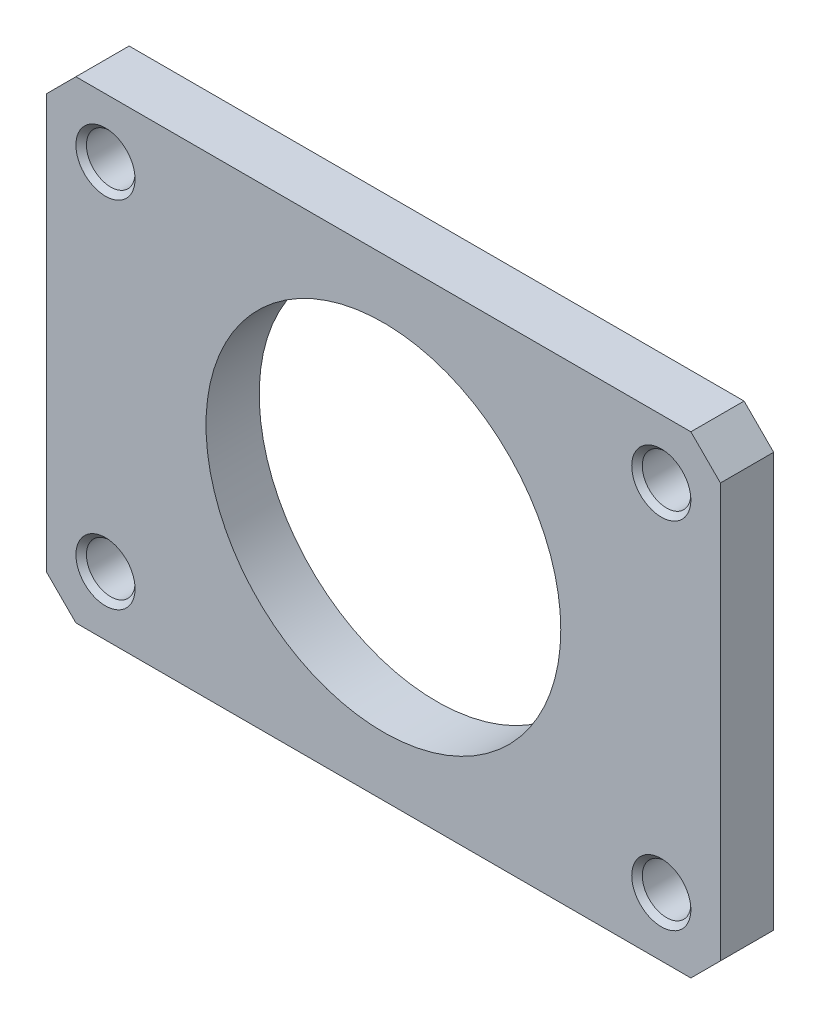
ISO-10303-21;
HEADER;
FILE_DESCRIPTION(('STEP AP214'),'2;1');
FILE_NAME('part.step','',(''),(''),'','','');
FILE_SCHEMA(('AUTOMOTIVE_DESIGN { 1 0 10303 214 1 1 1 1 }'));
ENDSEC;
DATA;
#1=APPLICATION_CONTEXT('core data for automotive mechanical design processes');
#2=APPLICATION_PROTOCOL_DEFINITION('international standard','automotive_design',2000,#1);
#3=PRODUCT_CONTEXT('',#1,'mechanical');
#4=PRODUCT('Part','Part','',(#3));
#5=PRODUCT_RELATED_PRODUCT_CATEGORY('part','',(#4));
#6=PRODUCT_DEFINITION_FORMATION('','',#4);
#7=PRODUCT_DEFINITION_CONTEXT('part definition',#1,'design');
#8=PRODUCT_DEFINITION('design','',#6,#7);
#9=PRODUCT_DEFINITION_SHAPE('','',#8);
#10=(LENGTH_UNIT() NAMED_UNIT(*) SI_UNIT(.MILLI.,.METRE.));
#11=(NAMED_UNIT(*) PLANE_ANGLE_UNIT() SI_UNIT($,.RADIAN.));
#12=(NAMED_UNIT(*) SI_UNIT($,.STERADIAN.) SOLID_ANGLE_UNIT());
#13=UNCERTAINTY_MEASURE_WITH_UNIT(LENGTH_MEASURE(1.E-05),#10,'distance_accuracy_value','');
#14=(GEOMETRIC_REPRESENTATION_CONTEXT(3) GLOBAL_UNCERTAINTY_ASSIGNED_CONTEXT((#13)) GLOBAL_UNIT_ASSIGNED_CONTEXT((#10,
#11,#12)) REPRESENTATION_CONTEXT('',''));
#15=CARTESIAN_POINT('',(0.,0.,0.));
#16=DIRECTION('',(0.,0.,1.));
#17=DIRECTION('',(1.,0.,0.));
#18=AXIS2_PLACEMENT_3D('',#15,#16,#17);
#19=CARTESIAN_POINT('',(0.,0.,4.5));
#20=DIRECTION('',(0.,0.,-1.));
#21=DIRECTION('',(-1.,0.,0.));
#22=AXIS2_PLACEMENT_3D('',#19,#20,#21);
#23=PLANE('',#22);
#24=CARTESIAN_POINT('',(-14.25,-10.,4.5));
#25=DIRECTION('',(0.,0.,1.));
#26=DIRECTION('',(1.,0.,0.));
#27=AXIS2_PLACEMENT_3D('',#24,#25,#26);
#28=CIRCLE('',#27,15.);
#29=CARTESIAN_POINT('',(0.749999999999994,-10.,4.5));
#30=VERTEX_POINT('',#29);
#31=EDGE_CURVE('E387',#30,#30,#28,.T.);
#32=ORIENTED_EDGE('',*,*,#31,.F.);
#33=EDGE_LOOP('',(#32));
#34=FACE_BOUND('',#33,.T.);
#35=CARTESIAN_POINT('',(9.24999999999999,5.,4.5));
#36=DIRECTION('',(0.,0.,-1.));
#37=DIRECTION('',(-1.,0.,0.));
#38=AXIS2_PLACEMENT_3D('',#35,#36,#37);
#39=CIRCLE('',#38,2.5);
#40=CARTESIAN_POINT('',(6.75,5.,4.5));
#41=VERTEX_POINT('',#40);
#42=EDGE_CURVE('E11',#41,#41,#39,.T.);
#43=ORIENTED_EDGE('',*,*,#42,.T.);
#44=EDGE_LOOP('',(#43));
#45=FACE_BOUND('',#44,.T.);
#46=DIRECTION('',(0.,1.,0.));
#47=VECTOR('',#46,1.);
#48=CARTESIAN_POINT('',(14.25,-10.,4.5));
#49=LINE('',#48,#47);
#50=CARTESIAN_POINT('',(14.25,-27.5,4.5));
#51=VERTEX_POINT('',#50);
#52=CARTESIAN_POINT('',(14.25,7.49999999999999,4.5));
#53=VERTEX_POINT('',#52);
#54=EDGE_CURVE('E194',#51,#53,#49,.T.);
#55=ORIENTED_EDGE('',*,*,#54,.T.);
#56=DIRECTION('',(0.707106781186547,-0.707106781186549,0.));
#57=VECTOR('',#56,1.);
#58=CARTESIAN_POINT('',(11.75,10.,4.5));
#59=LINE('',#58,#57);
#60=CARTESIAN_POINT('',(11.75,10.,4.5));
#61=VERTEX_POINT('',#60);
#62=EDGE_CURVE('E206',#53,#61,#59,.F.);
#63=ORIENTED_EDGE('',*,*,#62,.T.);
#64=DIRECTION('',(-1.,0.,0.));
#65=VECTOR('',#64,1.);
#66=CARTESIAN_POINT('',(-14.25,10.,4.5));
#67=LINE('',#66,#65);
#68=CARTESIAN_POINT('',(-40.25,10.,4.5));
#69=VERTEX_POINT('',#68);
#70=EDGE_CURVE('E196',#61,#69,#67,.T.);
#71=ORIENTED_EDGE('',*,*,#70,.T.);
#72=DIRECTION('',(-0.707106781186547,-0.707106781186549,0.));
#73=VECTOR('',#72,1.);
#74=CARTESIAN_POINT('',(-40.25,10.,4.5));
#75=LINE('',#74,#73);
#76=CARTESIAN_POINT('',(-42.75,7.49999999999999,4.5));
#77=VERTEX_POINT('',#76);
#78=EDGE_CURVE('E157',#77,#69,#75,.F.);
#79=ORIENTED_EDGE('',*,*,#78,.F.);
#80=DIRECTION('',(0.,1.,0.));
#81=VECTOR('',#80,1.);
#82=CARTESIAN_POINT('',(-42.75,-10.,4.5));
#83=LINE('',#82,#81);
#84=CARTESIAN_POINT('',(-42.75,-27.5,4.5));
#85=VERTEX_POINT('',#84);
#86=EDGE_CURVE('E145',#85,#77,#83,.T.);
#87=ORIENTED_EDGE('',*,*,#86,.F.);
#88=DIRECTION('',(-0.707106781186547,0.707106781186549,0.));
#89=VECTOR('',#88,1.);
#90=CARTESIAN_POINT('',(-40.25,-30.,4.5));
#91=LINE('',#90,#89);
#92=CARTESIAN_POINT('',(-40.25,-30.,4.5));
#93=VERTEX_POINT('',#92);
#94=EDGE_CURVE('E127',#85,#93,#91,.F.);
#95=ORIENTED_EDGE('',*,*,#94,.T.);
#96=DIRECTION('',(-1.,0.,0.));
#97=VECTOR('',#96,1.);
#98=CARTESIAN_POINT('',(-14.25,-30.,4.5));
#99=LINE('',#98,#97);
#100=CARTESIAN_POINT('',(11.75,-30.,4.5));
#101=VERTEX_POINT('',#100);
#102=EDGE_CURVE('E111',#101,#93,#99,.T.);
#103=ORIENTED_EDGE('',*,*,#102,.F.);
#104=DIRECTION('',(0.707106781186547,0.707106781186549,0.));
#105=VECTOR('',#104,1.);
#106=CARTESIAN_POINT('',(11.75,-30.,4.5));
#107=LINE('',#106,#105);
#108=EDGE_CURVE('E178',#51,#101,#107,.F.);
#109=ORIENTED_EDGE('',*,*,#108,.F.);
#110=EDGE_LOOP('',(#55,#63,#71,#79,#87,#95,#103,#109));
#111=FACE_BOUND('',#110,.T.);
#112=CARTESIAN_POINT('',(9.24999999999999,-25.,4.5));
#113=DIRECTION('',(0.,0.,1.));
#114=DIRECTION('',(-1.,0.,0.));
#115=AXIS2_PLACEMENT_3D('',#112,#113,#114);
#116=CIRCLE('',#115,2.5);
#117=CARTESIAN_POINT('',(6.75,-25.,4.5));
#118=VERTEX_POINT('',#117);
#119=EDGE_CURVE('E190',#118,#118,#116,.T.);
#120=ORIENTED_EDGE('',*,*,#119,.F.);
#121=EDGE_LOOP('',(#120));
#122=FACE_BOUND('',#121,.T.);
#123=CARTESIAN_POINT('',(-37.75,5.,4.5));
#124=DIRECTION('',(0.,0.,1.));
#125=DIRECTION('',(1.,0.,0.));
#126=AXIS2_PLACEMENT_3D('',#123,#124,#125);
#127=CIRCLE('',#126,2.5);
#128=CARTESIAN_POINT('',(-35.25,5.,4.5));
#129=VERTEX_POINT('',#128);
#130=EDGE_CURVE('E112',#129,#129,#127,.T.);
#131=ORIENTED_EDGE('',*,*,#130,.F.);
#132=EDGE_LOOP('',(#131));
#133=FACE_BOUND('',#132,.T.);
#134=CARTESIAN_POINT('',(-37.75,-25.,4.5));
#135=DIRECTION('',(0.,0.,-1.));
#136=DIRECTION('',(1.,0.,0.));
#137=AXIS2_PLACEMENT_3D('',#134,#135,#136);
#138=CIRCLE('',#137,2.5);
#139=CARTESIAN_POINT('',(-35.25,-25.,4.5));
#140=VERTEX_POINT('',#139);
#141=EDGE_CURVE('E141',#140,#140,#138,.T.);
#142=ORIENTED_EDGE('',*,*,#141,.T.);
#143=EDGE_LOOP('',(#142));
#144=FACE_BOUND('',#143,.T.);
#145=ADVANCED_FACE('F36',(#34,#45,#111,#122,#133,#144),#23,.F.);
#146=CARTESIAN_POINT('',(0.,0.,0.));
#147=DIRECTION('',(0.,0.,-1.));
#148=DIRECTION('',(-1.,0.,0.));
#149=AXIS2_PLACEMENT_3D('',#146,#147,#148);
#150=PLANE('',#149);
#151=CARTESIAN_POINT('',(-14.25,-10.,0.));
#152=DIRECTION('',(0.,0.,1.));
#153=DIRECTION('',(1.,0.,0.));
#154=AXIS2_PLACEMENT_3D('',#151,#152,#153);
#155=CIRCLE('',#154,15.);
#156=CARTESIAN_POINT('',(0.749999999999994,-10.,0.));
#157=VERTEX_POINT('',#156);
#158=EDGE_CURVE('E121',#157,#157,#155,.T.);
#159=ORIENTED_EDGE('',*,*,#158,.T.);
#160=EDGE_LOOP('',(#159));
#161=FACE_BOUND('',#160,.T.);
#162=CARTESIAN_POINT('',(9.24999999999999,5.,0.));
#163=DIRECTION('',(0.,0.,-1.));
#164=DIRECTION('',(-1.,0.,0.));
#165=AXIS2_PLACEMENT_3D('',#162,#163,#164);
#166=CIRCLE('',#165,2.50000000000001);
#167=CARTESIAN_POINT('',(6.74999999999999,5.,0.));
#168=VERTEX_POINT('',#167);
#169=EDGE_CURVE('E208',#168,#168,#166,.F.);
#170=ORIENTED_EDGE('',*,*,#169,.T.);
#171=EDGE_LOOP('',(#170));
#172=FACE_BOUND('',#171,.T.);
#173=DIRECTION('',(-1.,0.,0.));
#174=VECTOR('',#173,1.);
#175=CARTESIAN_POINT('',(-14.25,10.,0.));
#176=LINE('',#175,#174);
#177=CARTESIAN_POINT('',(11.75,10.,0.));
#178=VERTEX_POINT('',#177);
#179=CARTESIAN_POINT('',(-40.25,10.,0.));
#180=VERTEX_POINT('',#179);
#181=EDGE_CURVE('E197',#178,#180,#176,.T.);
#182=ORIENTED_EDGE('',*,*,#181,.F.);
#183=DIRECTION('',(-0.707106781186547,0.707106781186549,0.));
#184=VECTOR('',#183,1.);
#185=CARTESIAN_POINT('',(10.875,10.875,0.));
#186=LINE('',#185,#184);
#187=CARTESIAN_POINT('',(14.25,7.49999999999999,0.));
#188=VERTEX_POINT('',#187);
#189=EDGE_CURVE('E59',#178,#188,#186,.F.);
#190=ORIENTED_EDGE('',*,*,#189,.T.);
#191=DIRECTION('',(0.,1.,0.));
#192=VECTOR('',#191,1.);
#193=CARTESIAN_POINT('',(14.25,-10.,0.));
#194=LINE('',#193,#192);
#195=CARTESIAN_POINT('',(14.25,-27.5,0.));
#196=VERTEX_POINT('',#195);
#197=EDGE_CURVE('E193',#196,#188,#194,.T.);
#198=ORIENTED_EDGE('',*,*,#197,.F.);
#199=DIRECTION('',(-0.707106781186547,-0.707106781186549,0.));
#200=VECTOR('',#199,1.);
#201=CARTESIAN_POINT('',(10.875,-30.875,0.));
#202=LINE('',#201,#200);
#203=CARTESIAN_POINT('',(11.75,-30.,0.));
#204=VERTEX_POINT('',#203);
#205=EDGE_CURVE('E109',#204,#196,#202,.F.);
#206=ORIENTED_EDGE('',*,*,#205,.F.);
#207=DIRECTION('',(-1.,0.,0.));
#208=VECTOR('',#207,1.);
#209=CARTESIAN_POINT('',(-14.25,-30.,0.));
#210=LINE('',#209,#208);
#211=CARTESIAN_POINT('',(-40.25,-30.,0.));
#212=VERTEX_POINT('',#211);
#213=EDGE_CURVE('E101',#204,#212,#210,.T.);
#214=ORIENTED_EDGE('',*,*,#213,.T.);
#215=DIRECTION('',(0.707106781186547,-0.707106781186549,0.));
#216=VECTOR('',#215,1.);
#217=CARTESIAN_POINT('',(-39.375,-30.875,0.));
#218=LINE('',#217,#216);
#219=CARTESIAN_POINT('',(-42.75,-27.5,0.));
#220=VERTEX_POINT('',#219);
#221=EDGE_CURVE('E107',#212,#220,#218,.F.);
#222=ORIENTED_EDGE('',*,*,#221,.T.);
#223=DIRECTION('',(0.,1.,0.));
#224=VECTOR('',#223,1.);
#225=CARTESIAN_POINT('',(-42.75,-10.,0.));
#226=LINE('',#225,#224);
#227=CARTESIAN_POINT('',(-42.75,7.49999999999999,0.));
#228=VERTEX_POINT('',#227);
#229=EDGE_CURVE('E144',#220,#228,#226,.T.);
#230=ORIENTED_EDGE('',*,*,#229,.T.);
#231=DIRECTION('',(0.707106781186547,0.707106781186549,0.));
#232=VECTOR('',#231,1.);
#233=CARTESIAN_POINT('',(-39.375,10.875,0.));
#234=LINE('',#233,#232);
#235=EDGE_CURVE('E152',#180,#228,#234,.F.);
#236=ORIENTED_EDGE('',*,*,#235,.F.);
#237=EDGE_LOOP('',(#182,#190,#198,#206,#214,#222,#230,#236));
#238=FACE_BOUND('',#237,.T.);
#239=CARTESIAN_POINT('',(9.24999999999999,-25.,0.));
#240=DIRECTION('',(0.,0.,1.));
#241=DIRECTION('',(-1.,0.,0.));
#242=AXIS2_PLACEMENT_3D('',#239,#240,#241);
#243=CIRCLE('',#242,2.50000000000001);
#244=CARTESIAN_POINT('',(6.74999999999999,-25.,0.));
#245=VERTEX_POINT('',#244);
#246=EDGE_CURVE('E181',#245,#245,#243,.F.);
#247=ORIENTED_EDGE('',*,*,#246,.F.);
#248=EDGE_LOOP('',(#247));
#249=FACE_BOUND('',#248,.T.);
#250=CARTESIAN_POINT('',(-37.75,5.,0.));
#251=DIRECTION('',(0.,0.,1.));
#252=DIRECTION('',(1.,0.,0.));
#253=AXIS2_PLACEMENT_3D('',#250,#251,#252);
#254=CIRCLE('',#253,2.50000000000001);
#255=CARTESIAN_POINT('',(-35.25,5.,0.));
#256=VERTEX_POINT('',#255);
#257=EDGE_CURVE('E160',#256,#256,#254,.F.);
#258=ORIENTED_EDGE('',*,*,#257,.F.);
#259=EDGE_LOOP('',(#258));
#260=FACE_BOUND('',#259,.T.);
#261=CARTESIAN_POINT('',(-37.75,-25.,0.));
#262=DIRECTION('',(0.,0.,-1.));
#263=DIRECTION('',(1.,0.,0.));
#264=AXIS2_PLACEMENT_3D('',#261,#262,#263);
#265=CIRCLE('',#264,2.50000000000001);
#266=CARTESIAN_POINT('',(-35.25,-25.,0.));
#267=VERTEX_POINT('',#266);
#268=EDGE_CURVE('E132',#267,#267,#265,.F.);
#269=ORIENTED_EDGE('',*,*,#268,.T.);
#270=EDGE_LOOP('',(#269));
#271=FACE_BOUND('',#270,.T.);
#272=ADVANCED_FACE('F103',(#161,#172,#238,#249,#260,#271),#150,.T.);
#273=CARTESIAN_POINT('',(14.25,-10.,4.5));
#274=DIRECTION('',(-1.,0.,0.));
#275=DIRECTION('',(0.,0.,1.));
#276=AXIS2_PLACEMENT_3D('',#273,#274,#275);
#277=PLANE('',#276);
#278=ORIENTED_EDGE('',*,*,#197,.T.);
#279=DIRECTION('',(0.,0.,1.));
#280=VECTOR('',#279,1.);
#281=CARTESIAN_POINT('',(14.25,7.49999999999999,4.5));
#282=LINE('',#281,#280);
#283=EDGE_CURVE('E51',#188,#53,#282,.T.);
#284=ORIENTED_EDGE('',*,*,#283,.T.);
#285=ORIENTED_EDGE('',*,*,#54,.F.);
#286=DIRECTION('',(0.,0.,1.));
#287=VECTOR('',#286,1.);
#288=CARTESIAN_POINT('',(14.25,-27.5,4.5));
#289=LINE('',#288,#287);
#290=EDGE_CURVE('E175',#196,#51,#289,.T.);
#291=ORIENTED_EDGE('',*,*,#290,.F.);
#292=EDGE_LOOP('',(#278,#284,#285,#291));
#293=FACE_BOUND('',#292,.T.);
#294=ADVANCED_FACE('F226',(#293),#277,.F.);
#295=CARTESIAN_POINT('',(-14.25,10.,4.5));
#296=DIRECTION('',(0.,-1.,0.));
#297=DIRECTION('',(0.,0.,-1.));
#298=AXIS2_PLACEMENT_3D('',#295,#296,#297);
#299=PLANE('',#298);
#300=ORIENTED_EDGE('',*,*,#70,.F.);
#301=DIRECTION('',(0.,0.,-1.));
#302=VECTOR('',#301,1.);
#303=CARTESIAN_POINT('',(11.75,10.,4.5));
#304=LINE('',#303,#302);
#305=EDGE_CURVE('E199',#61,#178,#304,.T.);
#306=ORIENTED_EDGE('',*,*,#305,.T.);
#307=ORIENTED_EDGE('',*,*,#181,.T.);
#308=DIRECTION('',(0.,0.,-1.));
#309=VECTOR('',#308,1.);
#310=CARTESIAN_POINT('',(-40.25,10.,4.5));
#311=LINE('',#310,#309);
#312=EDGE_CURVE('E148',#69,#180,#311,.T.);
#313=ORIENTED_EDGE('',*,*,#312,.F.);
#314=EDGE_LOOP('',(#300,#306,#307,#313));
#315=FACE_BOUND('',#314,.T.);
#316=ADVANCED_FACE('F233',(#315),#299,.F.);
#317=CARTESIAN_POINT('',(9.24999999999999,5.,4.5));
#318=DIRECTION('',(0.,0.,-1.));
#319=DIRECTION('',(-1.,0.,0.));
#320=AXIS2_PLACEMENT_3D('',#317,#318,#319);
#321=CYLINDRICAL_SURFACE('',#320,2.055);
#322=CARTESIAN_POINT('',(9.24999999999999,5.,0.445000000000008));
#323=DIRECTION('',(0.,0.,-1.));
#324=DIRECTION('',(-1.,0.,0.));
#325=AXIS2_PLACEMENT_3D('',#322,#323,#324);
#326=CIRCLE('',#325,2.055);
#327=CARTESIAN_POINT('',(7.19499999999999,5.,0.445000000000008));
#328=VERTEX_POINT('',#327);
#329=EDGE_CURVE('E44',#328,#328,#326,.T.);
#330=ORIENTED_EDGE('',*,*,#329,.T.);
#331=EDGE_LOOP('',(#330));
#332=FACE_BOUND('',#331,.T.);
#333=CARTESIAN_POINT('',(9.24999999999999,5.,4.055));
#334=DIRECTION('',(0.,0.,-1.));
#335=DIRECTION('',(-1.,0.,0.));
#336=AXIS2_PLACEMENT_3D('',#333,#334,#335);
#337=CIRCLE('',#336,2.055);
#338=CARTESIAN_POINT('',(7.19499999999999,5.,4.055));
#339=VERTEX_POINT('',#338);
#340=EDGE_CURVE('E211',#339,#339,#337,.F.);
#341=ORIENTED_EDGE('',*,*,#340,.T.);
#342=EDGE_LOOP('',(#341));
#343=FACE_BOUND('',#342,.T.);
#344=ADVANCED_FACE('F216',(#332,#343),#321,.F.);
#345=CARTESIAN_POINT('',(11.75,10.,4.5));
#346=DIRECTION('',(-0.707106781186549,-0.707106781186547,0.));
#347=DIRECTION('',(0.,0.,-1.));
#348=AXIS2_PLACEMENT_3D('',#345,#346,#347);
#349=PLANE('',#348);
#350=ORIENTED_EDGE('',*,*,#62,.F.);
#351=ORIENTED_EDGE('',*,*,#283,.F.);
#352=ORIENTED_EDGE('',*,*,#189,.F.);
#353=ORIENTED_EDGE('',*,*,#305,.F.);
#354=EDGE_LOOP('',(#350,#351,#352,#353));
#355=FACE_BOUND('',#354,.T.);
#356=ADVANCED_FACE('F222',(#355),#349,.F.);
#357=CARTESIAN_POINT('',(9.24999999999999,5.,0.));
#358=DIRECTION('',(0.,0.,-1.));
#359=DIRECTION('',(-1.,0.,0.));
#360=AXIS2_PLACEMENT_3D('',#357,#358,#359);
#361=CONICAL_SURFACE('',#360,2.50000000000001,0.785398163397447);
#362=ORIENTED_EDGE('',*,*,#329,.F.);
#363=EDGE_LOOP('',(#362));
#364=FACE_BOUND('',#363,.T.);
#365=ORIENTED_EDGE('',*,*,#169,.F.);
#366=EDGE_LOOP('',(#365));
#367=FACE_BOUND('',#366,.T.);
#368=ADVANCED_FACE('F219',(#364,#367),#361,.F.);
#369=CARTESIAN_POINT('',(9.24999999999999,5.,4.055));
#370=DIRECTION('',(0.,0.,1.));
#371=DIRECTION('',(1.,0.,0.));
#372=AXIS2_PLACEMENT_3D('',#369,#370,#371);
#373=CONICAL_SURFACE('',#372,2.055,0.785398163397446);
#374=ORIENTED_EDGE('',*,*,#42,.F.);
#375=EDGE_LOOP('',(#374));
#376=FACE_BOUND('',#375,.T.);
#377=ORIENTED_EDGE('',*,*,#340,.F.);
#378=EDGE_LOOP('',(#377));
#379=FACE_BOUND('',#378,.T.);
#380=ADVANCED_FACE('F38',(#376,#379),#373,.F.);
#381=CARTESIAN_POINT('',(-14.25,-30.,4.5));
#382=DIRECTION('',(0.,1.,0.));
#383=DIRECTION('',(0.,0.,-1.));
#384=AXIS2_PLACEMENT_3D('',#381,#382,#383);
#385=PLANE('',#384);
#386=ORIENTED_EDGE('',*,*,#102,.T.);
#387=DIRECTION('',(0.,0.,-1.));
#388=VECTOR('',#387,1.);
#389=CARTESIAN_POINT('',(-40.25,-30.,4.5));
#390=LINE('',#389,#388);
#391=EDGE_CURVE('E115',#93,#212,#390,.T.);
#392=ORIENTED_EDGE('',*,*,#391,.T.);
#393=ORIENTED_EDGE('',*,*,#213,.F.);
#394=DIRECTION('',(0.,0.,-1.));
#395=VECTOR('',#394,1.);
#396=CARTESIAN_POINT('',(11.75,-30.,4.5));
#397=LINE('',#396,#395);
#398=EDGE_CURVE('E171',#101,#204,#397,.T.);
#399=ORIENTED_EDGE('',*,*,#398,.F.);
#400=EDGE_LOOP('',(#386,#392,#393,#399));
#401=FACE_BOUND('',#400,.T.);
#402=ADVANCED_FACE('F116',(#401),#385,.F.);
#403=CARTESIAN_POINT('',(9.24999999999999,-25.,4.5));
#404=DIRECTION('',(0.,0.,-1.));
#405=DIRECTION('',(-1.,0.,0.));
#406=AXIS2_PLACEMENT_3D('',#403,#404,#405);
#407=CYLINDRICAL_SURFACE('',#406,2.055);
#408=CARTESIAN_POINT('',(9.24999999999999,-25.,0.445000000000008));
#409=DIRECTION('',(0.,0.,1.));
#410=DIRECTION('',(-1.,0.,0.));
#411=AXIS2_PLACEMENT_3D('',#408,#409,#410);
#412=CIRCLE('',#411,2.055);
#413=CARTESIAN_POINT('',(7.19499999999999,-25.,0.445000000000008));
#414=VERTEX_POINT('',#413);
#415=EDGE_CURVE('E187',#414,#414,#412,.T.);
#416=ORIENTED_EDGE('',*,*,#415,.F.);
#417=EDGE_LOOP('',(#416));
#418=FACE_BOUND('',#417,.T.);
#419=CARTESIAN_POINT('',(9.24999999999999,-25.,4.055));
#420=DIRECTION('',(0.,0.,1.));
#421=DIRECTION('',(-1.,0.,0.));
#422=AXIS2_PLACEMENT_3D('',#419,#420,#421);
#423=CIRCLE('',#422,2.055);
#424=CARTESIAN_POINT('',(7.19499999999999,-25.,4.055));
#425=VERTEX_POINT('',#424);
#426=EDGE_CURVE('E184',#425,#425,#423,.F.);
#427=ORIENTED_EDGE('',*,*,#426,.F.);
#428=EDGE_LOOP('',(#427));
#429=FACE_BOUND('',#428,.T.);
#430=ADVANCED_FACE('F267',(#418,#429),#407,.F.);
#431=CARTESIAN_POINT('',(11.75,-30.,4.5));
#432=DIRECTION('',(-0.707106781186549,0.707106781186547,0.));
#433=DIRECTION('',(0.,0.,-1.));
#434=AXIS2_PLACEMENT_3D('',#431,#432,#433);
#435=PLANE('',#434);
#436=ORIENTED_EDGE('',*,*,#108,.T.);
#437=ORIENTED_EDGE('',*,*,#398,.T.);
#438=ORIENTED_EDGE('',*,*,#205,.T.);
#439=ORIENTED_EDGE('',*,*,#290,.T.);
#440=EDGE_LOOP('',(#436,#437,#438,#439));
#441=FACE_BOUND('',#440,.T.);
#442=ADVANCED_FACE('F263',(#441),#435,.F.);
#443=CARTESIAN_POINT('',(9.24999999999999,-25.,0.));
#444=DIRECTION('',(0.,0.,-1.));
#445=DIRECTION('',(-1.,0.,0.));
#446=AXIS2_PLACEMENT_3D('',#443,#444,#445);
#447=CONICAL_SURFACE('',#446,2.50000000000001,0.785398163397447);
#448=ORIENTED_EDGE('',*,*,#415,.T.);
#449=EDGE_LOOP('',(#448));
#450=FACE_BOUND('',#449,.T.);
#451=ORIENTED_EDGE('',*,*,#246,.T.);
#452=EDGE_LOOP('',(#451));
#453=FACE_BOUND('',#452,.T.);
#454=ADVANCED_FACE('F266',(#450,#453),#447,.F.);
#455=CARTESIAN_POINT('',(9.24999999999999,-25.,4.055));
#456=DIRECTION('',(0.,0.,1.));
#457=DIRECTION('',(1.,0.,0.));
#458=AXIS2_PLACEMENT_3D('',#455,#456,#457);
#459=CONICAL_SURFACE('',#458,2.055,0.785398163397446);
#460=ORIENTED_EDGE('',*,*,#119,.T.);
#461=EDGE_LOOP('',(#460));
#462=FACE_BOUND('',#461,.T.);
#463=ORIENTED_EDGE('',*,*,#426,.T.);
#464=EDGE_LOOP('',(#463));
#465=FACE_BOUND('',#464,.T.);
#466=ADVANCED_FACE('F273',(#462,#465),#459,.F.);
#467=CARTESIAN_POINT('',(-42.75,-10.,4.5));
#468=DIRECTION('',(1.,0.,0.));
#469=DIRECTION('',(0.,0.,1.));
#470=AXIS2_PLACEMENT_3D('',#467,#468,#469);
#471=PLANE('',#470);
#472=ORIENTED_EDGE('',*,*,#229,.F.);
#473=DIRECTION('',(0.,0.,1.));
#474=VECTOR('',#473,1.);
#475=CARTESIAN_POINT('',(-42.75,-27.5,4.5));
#476=LINE('',#475,#474);
#477=EDGE_CURVE('E124',#220,#85,#476,.T.);
#478=ORIENTED_EDGE('',*,*,#477,.T.);
#479=ORIENTED_EDGE('',*,*,#86,.T.);
#480=DIRECTION('',(0.,0.,1.));
#481=VECTOR('',#480,1.);
#482=CARTESIAN_POINT('',(-42.75,7.49999999999999,4.5));
#483=LINE('',#482,#481);
#484=EDGE_CURVE('E155',#228,#77,#483,.T.);
#485=ORIENTED_EDGE('',*,*,#484,.F.);
#486=EDGE_LOOP('',(#472,#478,#479,#485));
#487=FACE_BOUND('',#486,.T.);
#488=ADVANCED_FACE('F261',(#487),#471,.F.);
#489=CARTESIAN_POINT('',(-37.75,5.,4.5));
#490=DIRECTION('',(0.,0.,-1.));
#491=DIRECTION('',(1.,0.,0.));
#492=AXIS2_PLACEMENT_3D('',#489,#490,#491);
#493=CYLINDRICAL_SURFACE('',#492,2.055);
#494=CARTESIAN_POINT('',(-37.75,5.,0.445000000000008));
#495=DIRECTION('',(0.,0.,1.));
#496=DIRECTION('',(1.,0.,0.));
#497=AXIS2_PLACEMENT_3D('',#494,#495,#496);
#498=CIRCLE('',#497,2.055);
#499=CARTESIAN_POINT('',(-35.695,5.,0.445000000000008));
#500=VERTEX_POINT('',#499);
#501=EDGE_CURVE('E166',#500,#500,#498,.T.);
#502=ORIENTED_EDGE('',*,*,#501,.F.);
#503=EDGE_LOOP('',(#502));
#504=FACE_BOUND('',#503,.T.);
#505=CARTESIAN_POINT('',(-37.75,5.,4.055));
#506=DIRECTION('',(0.,0.,1.));
#507=DIRECTION('',(1.,0.,0.));
#508=AXIS2_PLACEMENT_3D('',#505,#506,#507);
#509=CIRCLE('',#508,2.055);
#510=CARTESIAN_POINT('',(-35.695,5.,4.055));
#511=VERTEX_POINT('',#510);
#512=EDGE_CURVE('E163',#511,#511,#509,.F.);
#513=ORIENTED_EDGE('',*,*,#512,.F.);
#514=EDGE_LOOP('',(#513));
#515=FACE_BOUND('',#514,.T.);
#516=ADVANCED_FACE('F285',(#504,#515),#493,.F.);
#517=CARTESIAN_POINT('',(-40.25,10.,4.5));
#518=DIRECTION('',(0.707106781186549,-0.707106781186547,0.));
#519=DIRECTION('',(0.,0.,-1.));
#520=AXIS2_PLACEMENT_3D('',#517,#518,#519);
#521=PLANE('',#520);
#522=ORIENTED_EDGE('',*,*,#78,.T.);
#523=ORIENTED_EDGE('',*,*,#312,.T.);
#524=ORIENTED_EDGE('',*,*,#235,.T.);
#525=ORIENTED_EDGE('',*,*,#484,.T.);
#526=EDGE_LOOP('',(#522,#523,#524,#525));
#527=FACE_BOUND('',#526,.T.);
#528=ADVANCED_FACE('F258',(#527),#521,.F.);
#529=CARTESIAN_POINT('',(-37.75,5.,0.));
#530=DIRECTION('',(0.,0.,-1.));
#531=DIRECTION('',(1.,0.,0.));
#532=AXIS2_PLACEMENT_3D('',#529,#530,#531);
#533=CONICAL_SURFACE('',#532,2.50000000000001,0.785398163397447);
#534=ORIENTED_EDGE('',*,*,#501,.T.);
#535=EDGE_LOOP('',(#534));
#536=FACE_BOUND('',#535,.T.);
#537=ORIENTED_EDGE('',*,*,#257,.T.);
#538=EDGE_LOOP('',(#537));
#539=FACE_BOUND('',#538,.T.);
#540=ADVANCED_FACE('F314',(#536,#539),#533,.F.);
#541=CARTESIAN_POINT('',(-37.75,5.,4.055));
#542=DIRECTION('',(0.,0.,1.));
#543=DIRECTION('',(-1.,0.,0.));
#544=AXIS2_PLACEMENT_3D('',#541,#542,#543);
#545=CONICAL_SURFACE('',#544,2.055,0.785398163397446);
#546=ORIENTED_EDGE('',*,*,#130,.T.);
#547=EDGE_LOOP('',(#546));
#548=FACE_BOUND('',#547,.T.);
#549=ORIENTED_EDGE('',*,*,#512,.T.);
#550=EDGE_LOOP('',(#549));
#551=FACE_BOUND('',#550,.T.);
#552=ADVANCED_FACE('F306',(#548,#551),#545,.F.);
#553=CARTESIAN_POINT('',(-37.75,-25.,4.5));
#554=DIRECTION('',(0.,0.,-1.));
#555=DIRECTION('',(1.,0.,0.));
#556=AXIS2_PLACEMENT_3D('',#553,#554,#555);
#557=CYLINDRICAL_SURFACE('',#556,2.055);
#558=CARTESIAN_POINT('',(-37.75,-25.,0.445000000000008));
#559=DIRECTION('',(0.,0.,-1.));
#560=DIRECTION('',(1.,0.,0.));
#561=AXIS2_PLACEMENT_3D('',#558,#559,#560);
#562=CIRCLE('',#561,2.055);
#563=CARTESIAN_POINT('',(-35.695,-25.,0.445000000000008));
#564=VERTEX_POINT('',#563);
#565=EDGE_CURVE('E138',#564,#564,#562,.T.);
#566=ORIENTED_EDGE('',*,*,#565,.T.);
#567=EDGE_LOOP('',(#566));
#568=FACE_BOUND('',#567,.T.);
#569=CARTESIAN_POINT('',(-37.75,-25.,4.055));
#570=DIRECTION('',(0.,0.,-1.));
#571=DIRECTION('',(1.,0.,0.));
#572=AXIS2_PLACEMENT_3D('',#569,#570,#571);
#573=CIRCLE('',#572,2.055);
#574=CARTESIAN_POINT('',(-35.695,-25.,4.055));
#575=VERTEX_POINT('',#574);
#576=EDGE_CURVE('E135',#575,#575,#573,.F.);
#577=ORIENTED_EDGE('',*,*,#576,.T.);
#578=EDGE_LOOP('',(#577));
#579=FACE_BOUND('',#578,.T.);
#580=ADVANCED_FACE('F304',(#568,#579),#557,.F.);
#581=CARTESIAN_POINT('',(-40.25,-30.,4.5));
#582=DIRECTION('',(0.707106781186549,0.707106781186547,0.));
#583=DIRECTION('',(0.,0.,-1.));
#584=AXIS2_PLACEMENT_3D('',#581,#582,#583);
#585=PLANE('',#584);
#586=ORIENTED_EDGE('',*,*,#94,.F.);
#587=ORIENTED_EDGE('',*,*,#477,.F.);
#588=ORIENTED_EDGE('',*,*,#221,.F.);
#589=ORIENTED_EDGE('',*,*,#391,.F.);
#590=EDGE_LOOP('',(#586,#587,#588,#589));
#591=FACE_BOUND('',#590,.T.);
#592=ADVANCED_FACE('F123',(#591),#585,.F.);
#593=CARTESIAN_POINT('',(-37.75,-25.,0.));
#594=DIRECTION('',(0.,0.,-1.));
#595=DIRECTION('',(1.,0.,0.));
#596=AXIS2_PLACEMENT_3D('',#593,#594,#595);
#597=CONICAL_SURFACE('',#596,2.50000000000001,0.785398163397447);
#598=ORIENTED_EDGE('',*,*,#565,.F.);
#599=EDGE_LOOP('',(#598));
#600=FACE_BOUND('',#599,.T.);
#601=ORIENTED_EDGE('',*,*,#268,.F.);
#602=EDGE_LOOP('',(#601));
#603=FACE_BOUND('',#602,.T.);
#604=ADVANCED_FACE('F300',(#600,#603),#597,.F.);
#605=CARTESIAN_POINT('',(-37.75,-25.,4.055));
#606=DIRECTION('',(0.,0.,1.));
#607=DIRECTION('',(-1.,0.,0.));
#608=AXIS2_PLACEMENT_3D('',#605,#606,#607);
#609=CONICAL_SURFACE('',#608,2.055,0.785398163397446);
#610=ORIENTED_EDGE('',*,*,#141,.F.);
#611=EDGE_LOOP('',(#610));
#612=FACE_BOUND('',#611,.T.);
#613=ORIENTED_EDGE('',*,*,#576,.F.);
#614=EDGE_LOOP('',(#613));
#615=FACE_BOUND('',#614,.T.);
#616=ADVANCED_FACE('F296',(#612,#615),#609,.F.);
#617=CARTESIAN_POINT('',(-14.25,-10.,0.));
#618=DIRECTION('',(0.,0.,1.));
#619=DIRECTION('',(1.,0.,0.));
#620=AXIS2_PLACEMENT_3D('',#617,#618,#619);
#621=CYLINDRICAL_SURFACE('',#620,15.);
#622=ORIENTED_EDGE('',*,*,#158,.F.);
#623=EDGE_LOOP('',(#622));
#624=FACE_BOUND('',#623,.T.);
#625=ORIENTED_EDGE('',*,*,#31,.T.);
#626=EDGE_LOOP('',(#625));
#627=FACE_BOUND('',#626,.T.);
#628=ADVANCED_FACE('F299',(#624,#627),#621,.F.);
#629=CLOSED_SHELL('',(#145,#272,#294,#316,#344,#356,#368,#380,#402,#430,#442,#454,#466,#488,
#516,#528,#540,#552,#580,#592,#604,#616,#628));
#630=MANIFOLD_SOLID_BREP('B2',#629);
#631=ADVANCED_BREP_SHAPE_REPRESENTATION('',(#18,#630),#14);
#632=SHAPE_DEFINITION_REPRESENTATION(#9,#631);
ENDSEC;
END-ISO-10303-21;
